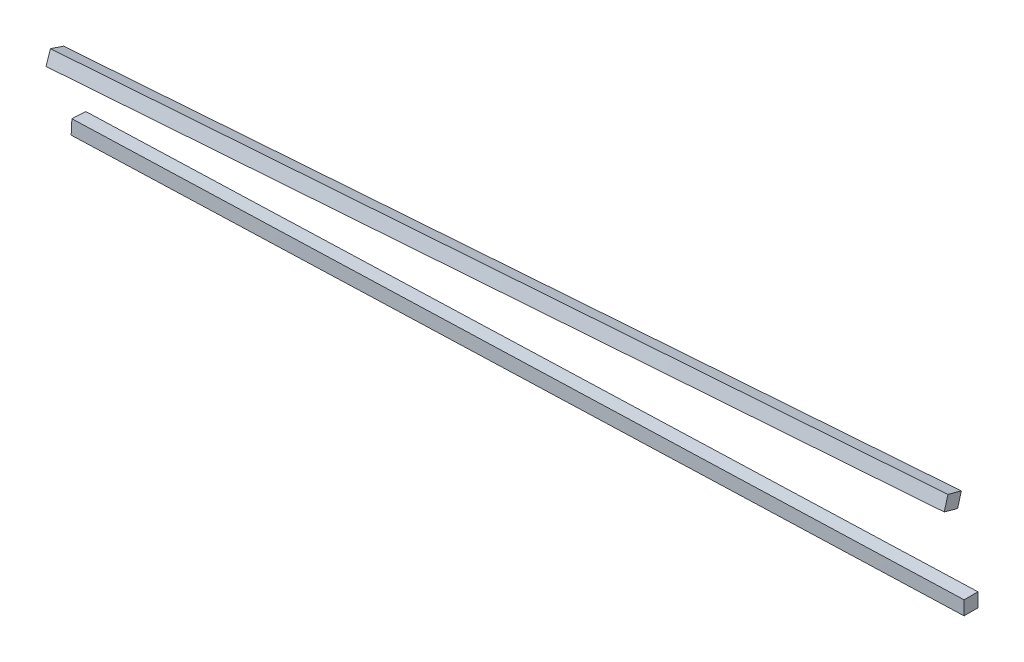
ISO-10303-21;
HEADER;
FILE_DESCRIPTION(('STEP AP214'),'2;1');
FILE_NAME('part.step','',(''),(''),'','','');
FILE_SCHEMA(('AUTOMOTIVE_DESIGN { 1 0 10303 214 1 1 1 1 }'));
ENDSEC;
DATA;
#1=APPLICATION_CONTEXT('core data for automotive mechanical design processes');
#2=APPLICATION_PROTOCOL_DEFINITION('international standard','automotive_design',2000,#1);
#3=PRODUCT_CONTEXT('',#1,'mechanical');
#4=PRODUCT('Part','Part','',(#3));
#5=PRODUCT_RELATED_PRODUCT_CATEGORY('part','',(#4));
#6=PRODUCT_DEFINITION_FORMATION('','',#4);
#7=PRODUCT_DEFINITION_CONTEXT('part definition',#1,'design');
#8=PRODUCT_DEFINITION('design','',#6,#7);
#9=PRODUCT_DEFINITION_SHAPE('','',#8);
#10=(LENGTH_UNIT() NAMED_UNIT(*) SI_UNIT(.MILLI.,.METRE.));
#11=(NAMED_UNIT(*) PLANE_ANGLE_UNIT() SI_UNIT($,.RADIAN.));
#12=(NAMED_UNIT(*) SI_UNIT($,.STERADIAN.) SOLID_ANGLE_UNIT());
#13=UNCERTAINTY_MEASURE_WITH_UNIT(LENGTH_MEASURE(1.E-05),#10,'distance_accuracy_value','');
#14=(GEOMETRIC_REPRESENTATION_CONTEXT(3) GLOBAL_UNCERTAINTY_ASSIGNED_CONTEXT((#13)) GLOBAL_UNIT_ASSIGNED_CONTEXT((#10,
#11,#12)) REPRESENTATION_CONTEXT('',''));
#15=CARTESIAN_POINT('',(0.,0.,0.));
#16=DIRECTION('',(0.,0.,1.));
#17=DIRECTION('',(1.,0.,0.));
#18=AXIS2_PLACEMENT_3D('',#15,#16,#17);
#19=CARTESIAN_POINT('',(-301.244,0.,0.));
#20=DIRECTION('',(1.,0.,0.));
#21=DIRECTION('',(0.,0.,-1.));
#22=AXIS2_PLACEMENT_3D('',#19,#20,#21);
#23=PLANE('',#22);
#24=DIRECTION('',(0.,0.998681754470149,-0.0513298479291129));
#25=VECTOR('',#24,1.);
#26=CARTESIAN_POINT('',(-301.244,-54.3131968202896,-76.6565977528262));
#27=LINE('',#26,#25);
#28=CARTESIAN_POINT('',(-301.244,-54.3131968202896,-76.6565977528262));
#29=VERTEX_POINT('',#28);
#30=CARTESIAN_POINT('',(-301.244,-49.4935586732166,-76.9043155989321));
#31=VERTEX_POINT('',#30);
#32=EDGE_CURVE('E143',#29,#31,#27,.T.);
#33=ORIENTED_EDGE('',*,*,#32,.F.);
#34=DIRECTION('',(0.,0.0513298479291094,0.998681754470149));
#35=VECTOR('',#34,1.);
#36=CARTESIAN_POINT('',(-301.244,-54.3131968202896,-76.6565977528262));
#37=LINE('',#36,#35);
#38=CARTESIAN_POINT('',(-301.244,-54.0654789741837,-71.8369596057533));
#39=VERTEX_POINT('',#38);
#40=EDGE_CURVE('E13',#29,#39,#37,.T.);
#41=ORIENTED_EDGE('',*,*,#40,.T.);
#42=DIRECTION('',(0.,0.998681754470149,-0.0513298479291069));
#43=VECTOR('',#42,1.);
#44=CARTESIAN_POINT('',(-301.244,-54.0654789741837,-71.8369596057533));
#45=LINE('',#44,#43);
#46=CARTESIAN_POINT('',(-301.244,-49.2458408271109,-72.0846774518592));
#47=VERTEX_POINT('',#46);
#48=EDGE_CURVE('E77',#39,#47,#45,.T.);
#49=ORIENTED_EDGE('',*,*,#48,.T.);
#50=DIRECTION('',(0.,0.0513298479290573,0.998681754470151));
#51=VECTOR('',#50,1.);
#52=CARTESIAN_POINT('',(-301.244,-49.4935586732166,-76.9043155989321));
#53=LINE('',#52,#51);
#54=EDGE_CURVE('E141',#31,#47,#53,.T.);
#55=ORIENTED_EDGE('',*,*,#54,.F.);
#56=EDGE_LOOP('',(#33,#41,#49,#55));
#57=FACE_BOUND('',#56,.T.);
#58=ADVANCED_FACE('F67',(#57),#23,.F.);
#59=CARTESIAN_POINT('',(0.,0.,0.));
#60=DIRECTION('',(-1.,0.,0.));
#61=DIRECTION('',(0.,0.,1.));
#62=AXIS2_PLACEMENT_3D('',#59,#60,#61);
#63=PLANE('',#62);
#64=DIRECTION('',(0.,0.999999249764561,-0.00122493686179626));
#65=VECTOR('',#64,1.);
#66=CARTESIAN_POINT('',(0.,-52.3639366169535,-80.6060154079807));
#67=LINE('',#66,#65);
#68=CARTESIAN_POINT('',(0.,-52.3639366169535,-80.6060154079807));
#69=VERTEX_POINT('',#68);
#70=CARTESIAN_POINT('',(0.,-47.5379402375898,-80.6119269532758));
#71=VERTEX_POINT('',#70);
#72=EDGE_CURVE('E116',#69,#71,#67,.T.);
#73=ORIENTED_EDGE('',*,*,#72,.F.);
#74=DIRECTION('',(0.,-0.00122493686179193,-0.999999249764561));
#75=VECTOR('',#74,1.);
#76=CARTESIAN_POINT('',(0.,-52.3639366169535,-80.6060154079807));
#77=LINE('',#76,#75);
#78=CARTESIAN_POINT('',(0.,-52.3698481622485,-85.4320117873445));
#79=VERTEX_POINT('',#78);
#80=EDGE_CURVE('E244',#69,#79,#77,.T.);
#81=ORIENTED_EDGE('',*,*,#80,.T.);
#82=DIRECTION('',(0.,0.999999249764561,-0.00122493686179337));
#83=VECTOR('',#82,1.);
#84=CARTESIAN_POINT('',(0.,-52.3698481622485,-85.4320117873445));
#85=LINE('',#84,#83);
#86=CARTESIAN_POINT('',(0.,-47.5438517828847,-85.4379233326396));
#87=VERTEX_POINT('',#86);
#88=EDGE_CURVE('E118',#79,#87,#85,.T.);
#89=ORIENTED_EDGE('',*,*,#88,.T.);
#90=DIRECTION('',(0.,-0.00122493686178187,-0.999999249764561));
#91=VECTOR('',#90,1.);
#92=CARTESIAN_POINT('',(0.,-47.5379402375898,-80.6119269532758));
#93=LINE('',#92,#91);
#94=EDGE_CURVE('E112',#71,#87,#93,.T.);
#95=ORIENTED_EDGE('',*,*,#94,.F.);
#96=EDGE_LOOP('',(#73,#81,#89,#95));
#97=FACE_BOUND('',#96,.T.);
#98=ADVANCED_FACE('F115',(#97),#63,.F.);
#99=CARTESIAN_POINT('',(0.,-47.5438517828847,-85.4379233326396));
#100=CARTESIAN_POINT('',(-301.244,-49.4935586732166,-76.9043155989321));
#101=CARTESIAN_POINT('',(0.,-48.3481845127787,-85.4369380750904));
#102=CARTESIAN_POINT('',(-301.244,-50.2968316977287,-76.8630292912478));
#103=CARTESIAN_POINT('',(0.,-49.1525172426727,-85.4359528175412));
#104=CARTESIAN_POINT('',(-301.244,-51.1001047222409,-76.8217429835635));
#105=CARTESIAN_POINT('',(0.,-50.7611827024606,-85.4339823024429));
#106=CARTESIAN_POINT('',(-301.244,-52.7066507712652,-76.7391703681949));
#107=CARTESIAN_POINT('',(0.,-51.5655154323546,-85.4329970448937));
#108=CARTESIAN_POINT('',(-301.244,-53.5099237957774,-76.6978840605105));
#109=CARTESIAN_POINT('',(0.,-52.3698481622485,-85.4320117873445));
#110=CARTESIAN_POINT('',(-301.244,-54.3131968202896,-76.6565977528262));
#111=B_SPLINE_SURFACE_WITH_KNOTS('',3,1,((#99,#100),(#101,#102),(#103,#104),(#105,#106),(#107,
#108),(#109,#110)),.UNSPECIFIED.,.F.,.F.,.F.,(4,2,4),(2,2),(0.,0.5,1.),(0.,1.),.UNSPECIFIED.);
#112=DIRECTION('',(-0.999555193249879,-0.00644820890520686,0.0291176278070954));
#113=VECTOR('',#112,1.);
#114=CARTESIAN_POINT('',(-150.622,-53.341522491269,-81.0443047700854));
#115=LINE('',#114,#113);
#116=EDGE_CURVE('E85',#79,#29,#115,.T.);
#117=DIRECTION('',(0.999578087821169,0.00646945428041606,-0.0283159409006493));
#118=VECTOR('',#117,1.);
#119=CARTESIAN_POINT('',(-150.622,-48.5187052280507,-81.1711194657858));
#120=LINE('',#119,#118);
#121=EDGE_CURVE('E156',#31,#87,#120,.T.);
#122=ORIENTED_EDGE('',*,*,#88,.F.);
#123=ORIENTED_EDGE('',*,*,#116,.T.);
#124=ORIENTED_EDGE('',*,*,#32,.T.);
#125=ORIENTED_EDGE('',*,*,#121,.T.);
#126=EDGE_LOOP('',(#122,#123,#124,#125));
#127=FACE_BOUND('',#126,.T.);
#128=ADVANCED_FACE('F197',(#127),#111,.T.);
#129=CARTESIAN_POINT('',(0.,-52.3698481622485,-85.4320117873445));
#130=CARTESIAN_POINT('',(-301.244,-54.3131968202896,-76.6565977528262));
#131=CARTESIAN_POINT('',(0.,-52.3688629046993,-84.6276790574505));
#132=CARTESIAN_POINT('',(-301.244,-54.2719105126053,-75.8533247283141));
#133=CARTESIAN_POINT('',(0.,-52.3678776471502,-83.8233463275565));
#134=CARTESIAN_POINT('',(-301.244,-54.2306242049209,-75.0500517038019));
#135=CARTESIAN_POINT('',(0.,-52.3659071320518,-82.2146808677686));
#136=CARTESIAN_POINT('',(-301.244,-54.1480515895523,-73.4435056547776));
#137=CARTESIAN_POINT('',(0.,-52.3649218745027,-81.4103481378746));
#138=CARTESIAN_POINT('',(-301.244,-54.106765281868,-72.6402326302655));
#139=CARTESIAN_POINT('',(0.,-52.3639366169535,-80.6060154079807));
#140=CARTESIAN_POINT('',(-301.244,-54.0654789741837,-71.8369596057533));
#141=B_SPLINE_SURFACE_WITH_KNOTS('',3,1,((#129,#130),(#131,#132),(#133,#134),(#135,#136),(#137,
#138),(#139,#140)),.UNSPECIFIED.,.F.,.F.,.F.,(4,2,4),(2,2),(0.,0.5,1.),(0.,1.),.UNSPECIFIED.);
#142=DIRECTION('',(-0.999560656696797,-0.00564590430345644,0.0290966896478778));
#143=VECTOR('',#142,1.);
#144=CARTESIAN_POINT('',(-150.622,-53.2147077955686,-76.221487506867));
#145=LINE('',#144,#143);
#146=EDGE_CURVE('E134',#69,#39,#145,.T.);
#147=ORIENTED_EDGE('',*,*,#80,.F.);
#148=ORIENTED_EDGE('',*,*,#146,.T.);
#149=ORIENTED_EDGE('',*,*,#40,.F.);
#150=ORIENTED_EDGE('',*,*,#116,.F.);
#151=EDGE_LOOP('',(#147,#148,#149,#150));
#152=FACE_BOUND('',#151,.T.);
#153=ADVANCED_FACE('F168',(#152),#141,.T.);
#154=CARTESIAN_POINT('',(0.,-47.5379402375898,-80.6119269532758));
#155=CARTESIAN_POINT('',(-301.244,-49.2458408271109,-72.0846774518592));
#156=CARTESIAN_POINT('',(0.,-47.5389254951389,-81.4162596831702));
#157=CARTESIAN_POINT('',(-301.244,-49.2871271347952,-72.8879504763713));
#158=CARTESIAN_POINT('',(0.,-47.5399107526881,-82.2205924130644));
#159=CARTESIAN_POINT('',(-301.244,-49.3284134424795,-73.6912235008835));
#160=CARTESIAN_POINT('',(0.,-47.5418812677864,-83.8292578728523));
#161=CARTESIAN_POINT('',(-301.244,-49.410986057848,-75.2977695499078));
#162=CARTESIAN_POINT('',(0.,-47.5428665253356,-84.6335906027461));
#163=CARTESIAN_POINT('',(-301.244,-49.4522723655323,-76.10104257442));
#164=CARTESIAN_POINT('',(0.,-47.5438517828847,-85.4379233326396));
#165=CARTESIAN_POINT('',(-301.244,-49.4935586732166,-76.9043155989321));
#166=B_SPLINE_SURFACE_WITH_KNOTS('',3,1,((#154,#155),(#156,#157),(#158,#159),(#160,#161),(#162,
#163),(#164,#165)),.UNSPECIFIED.,.F.,.F.,.F.,(4,2,4),(2,2),(0.,0.5,1.),(0.,1.),.UNSPECIFIED.);
#167=DIRECTION('',(-0.999583551643514,-0.00566713141880874,0.028294997883365));
#168=VECTOR('',#167,1.);
#169=CARTESIAN_POINT('',(-150.622,-48.3918905323504,-76.3483022025675));
#170=LINE('',#169,#168);
#171=EDGE_CURVE('E132',#71,#47,#170,.T.);
#172=ORIENTED_EDGE('',*,*,#94,.T.);
#173=ORIENTED_EDGE('',*,*,#121,.F.);
#174=ORIENTED_EDGE('',*,*,#54,.T.);
#175=ORIENTED_EDGE('',*,*,#171,.F.);
#176=EDGE_LOOP('',(#172,#173,#174,#175));
#177=FACE_BOUND('',#176,.T.);
#178=ADVANCED_FACE('F140',(#177),#166,.T.);
#179=CARTESIAN_POINT('',(0.,-52.3639366169535,-80.6060154079807));
#180=CARTESIAN_POINT('',(-301.244,-54.0654789741837,-71.8369596057533));
#181=CARTESIAN_POINT('',(0.,-51.5596038870595,-80.6070006655299));
#182=CARTESIAN_POINT('',(-301.244,-53.2622059496716,-71.8782459134376));
#183=CARTESIAN_POINT('',(0.,-50.7552711571656,-80.6079859230791));
#184=CARTESIAN_POINT('',(-301.244,-52.4589329251595,-71.9195322211219));
#185=CARTESIAN_POINT('',(0.,-49.1466056973777,-80.6099564381774));
#186=CARTESIAN_POINT('',(-301.244,-50.8523868761353,-72.0021048364905));
#187=CARTESIAN_POINT('',(0.,-48.3422729674837,-80.6109416957266));
#188=CARTESIAN_POINT('',(-301.244,-50.0491138516231,-72.0433911441748));
#189=CARTESIAN_POINT('',(0.,-47.5379402375898,-80.6119269532758));
#190=CARTESIAN_POINT('',(-301.244,-49.2458408271109,-72.0846774518592));
#191=B_SPLINE_SURFACE_WITH_KNOTS('',3,1,((#179,#180),(#181,#182),(#183,#184),(#185,#186),(#187,
#188),(#189,#190)),.UNSPECIFIED.,.F.,.F.,.F.,(4,2,4),(2,2),(0.,0.5,1.),(0.,1.),.UNSPECIFIED.);
#192=ORIENTED_EDGE('',*,*,#72,.T.);
#193=ORIENTED_EDGE('',*,*,#171,.T.);
#194=ORIENTED_EDGE('',*,*,#48,.F.);
#195=ORIENTED_EDGE('',*,*,#146,.F.);
#196=EDGE_LOOP('',(#192,#193,#194,#195));
#197=FACE_BOUND('',#196,.T.);
#198=ADVANCED_FACE('F131',(#197),#191,.T.);
#199=CLOSED_SHELL('',(#58,#98,#128,#153,#178,#198));
#200=MANIFOLD_SOLID_BREP('B2',#199);
#201=CARTESIAN_POINT('',(-301.244,0.,0.));
#202=DIRECTION('',(1.,0.,0.));
#203=DIRECTION('',(0.,0.,-1.));
#204=AXIS2_PLACEMENT_3D('',#201,#202,#203);
#205=PLANE('',#204);
#206=DIRECTION('',(0.,0.948597586448129,-0.316484784760317));
#207=VECTOR('',#206,1.);
#208=CARTESIAN_POINT('',(-301.244,-30.5643098408637,-67.6798509574859));
#209=LINE('',#208,#207);
#210=CARTESIAN_POINT('',(-301.244,-30.5643098408637,-67.6798509574859));
#211=VERTEX_POINT('',#210);
#212=CARTESIAN_POINT('',(-301.244,-25.986377888665,-69.2072065287391));
#213=VERTEX_POINT('',#212);
#214=EDGE_CURVE('E516',#211,#213,#209,.T.);
#215=ORIENTED_EDGE('',*,*,#214,.F.);
#216=DIRECTION('',(0.,0.316484784760316,0.948597586448129));
#217=VECTOR('',#216,1.);
#218=CARTESIAN_POINT('',(-301.244,-30.5643098408637,-67.6798509574859));
#219=LINE('',#218,#217);
#220=CARTESIAN_POINT('',(-301.244,-29.0369542696104,-63.1019190052872));
#221=VERTEX_POINT('',#220);
#222=EDGE_CURVE('E65',#211,#221,#219,.T.);
#223=ORIENTED_EDGE('',*,*,#222,.T.);
#224=DIRECTION('',(0.,0.948597586448129,-0.316484784760317));
#225=VECTOR('',#224,1.);
#226=CARTESIAN_POINT('',(-301.244,-29.0369542696104,-63.1019190052872));
#227=LINE('',#226,#225);
#228=CARTESIAN_POINT('',(-301.244,-24.4590223174117,-64.6292745765404));
#229=VERTEX_POINT('',#228);
#230=EDGE_CURVE('E401',#221,#229,#227,.T.);
#231=ORIENTED_EDGE('',*,*,#230,.T.);
#232=DIRECTION('',(0.,0.316484784760317,0.948597586448129));
#233=VECTOR('',#232,1.);
#234=CARTESIAN_POINT('',(-301.244,-25.986377888665,-69.2072065287391));
#235=LINE('',#234,#233);
#236=EDGE_CURVE('E443',#213,#229,#235,.T.);
#237=ORIENTED_EDGE('',*,*,#236,.F.);
#238=EDGE_LOOP('',(#215,#223,#231,#237));
#239=FACE_BOUND('',#238,.T.);
#240=ADVANCED_FACE('F391',(#239),#205,.F.);
#241=CARTESIAN_POINT('',(0.,0.,0.));
#242=DIRECTION('',(1.,0.,0.));
#243=DIRECTION('',(0.,0.,-1.));
#244=AXIS2_PLACEMENT_3D('',#241,#242,#243);
#245=PLANE('',#244);
#246=DIRECTION('',(0.,-0.264944987657992,-0.964263529080565));
#247=VECTOR('',#246,1.);
#248=CARTESIAN_POINT('',(0.,-17.6892857922132,-73.7225928427553));
#249=LINE('',#248,#247);
#250=CARTESIAN_POINT('',(0.,-17.6892857922132,-73.7225928427553));
#251=VERTEX_POINT('',#250);
#252=CARTESIAN_POINT('',(0.,-18.9679103026507,-78.3761286340981));
#253=VERTEX_POINT('',#252);
#254=EDGE_CURVE('E504',#251,#253,#249,.T.);
#255=ORIENTED_EDGE('',*,*,#254,.T.);
#256=DIRECTION('',(0.,0.964263529080565,-0.264944987657993));
#257=VECTOR('',#256,1.);
#258=CARTESIAN_POINT('',(0.,-18.9679103026507,-78.3761286340981));
#259=LINE('',#258,#257);
#260=CARTESIAN_POINT('',(0.,-14.3143745113079,-79.6547531445356));
#261=VERTEX_POINT('',#260);
#262=EDGE_CURVE('E463',#253,#261,#259,.T.);
#263=ORIENTED_EDGE('',*,*,#262,.T.);
#264=DIRECTION('',(0.,-0.264944987657993,-0.964263529080565));
#265=VECTOR('',#264,1.);
#266=CARTESIAN_POINT('',(0.,-13.0357500008704,-75.0012173531927));
#267=LINE('',#266,#265);
#268=CARTESIAN_POINT('',(0.,-13.0357500008704,-75.0012173531927));
#269=VERTEX_POINT('',#268);
#270=EDGE_CURVE('E440',#269,#261,#267,.T.);
#271=ORIENTED_EDGE('',*,*,#270,.F.);
#272=DIRECTION('',(0.,0.964263529080565,-0.264944987657993));
#273=VECTOR('',#272,1.);
#274=CARTESIAN_POINT('',(0.,-17.6892857922132,-73.7225928427553));
#275=LINE('',#274,#273);
#276=EDGE_CURVE('E447',#251,#269,#275,.T.);
#277=ORIENTED_EDGE('',*,*,#276,.F.);
#278=EDGE_LOOP('',(#255,#263,#271,#277));
#279=FACE_BOUND('',#278,.T.);
#280=ADVANCED_FACE('F462',(#279),#245,.T.);
#281=CARTESIAN_POINT('',(0.,-13.0357500008704,-75.0012173531927));
#282=CARTESIAN_POINT('',(-301.244,-24.4590223174117,-64.6292745765404));
#283=CARTESIAN_POINT('',(0.,-13.2488540859433,-75.7768066517498));
#284=CARTESIAN_POINT('',(-301.244,-24.7135815792873,-65.3922632352402));
#285=CARTESIAN_POINT('',(0.,-13.4619581710162,-76.5523959503069));
#286=CARTESIAN_POINT('',(-301.244,-24.9681408411628,-66.15525189394));
#287=CARTESIAN_POINT('',(0.,-13.888166341162,-78.1035745474211));
#288=CARTESIAN_POINT('',(-301.244,-25.4772593649139,-67.6812292113396));
#289=CARTESIAN_POINT('',(0.,-14.1012704262349,-78.8791638459783));
#290=CARTESIAN_POINT('',(-301.244,-25.7318186267895,-68.4442178700394));
#291=CARTESIAN_POINT('',(0.,-14.3143745113079,-79.6547531445356));
#292=CARTESIAN_POINT('',(-301.244,-25.986377888665,-69.2072065287391));
#293=B_SPLINE_SURFACE_WITH_KNOTS('',3,1,((#281,#282),(#283,#284),(#285,#286),(#287,#288),(#289,
#290),(#291,#292)),.UNSPECIFIED.,.F.,.F.,.F.,(4,2,4),(2,2),(0.,0.5,1.),(0.,1.),.UNSPECIFIED.);
#294=DIRECTION('',(-0.99865071131137,-0.0386937315771483,0.0346345482709159));
#295=VECTOR('',#294,1.);
#296=CARTESIAN_POINT('',(-150.622,-20.1503761999865,-74.4309798366373));
#297=LINE('',#296,#295);
#298=EDGE_CURVE('E446',#261,#213,#297,.T.);
#299=DIRECTION('',(0.998690874208296,0.0378706889303227,-0.0343852976286774));
#300=VECTOR('',#299,1.);
#301=CARTESIAN_POINT('',(-150.622,-18.7473861591411,-69.8152459648666));
#302=LINE('',#301,#300);
#303=EDGE_CURVE('E435',#229,#269,#302,.T.);
#304=ORIENTED_EDGE('',*,*,#270,.T.);
#305=ORIENTED_EDGE('',*,*,#298,.T.);
#306=ORIENTED_EDGE('',*,*,#236,.T.);
#307=ORIENTED_EDGE('',*,*,#303,.T.);
#308=EDGE_LOOP('',(#304,#305,#306,#307));
#309=FACE_BOUND('',#308,.T.);
#310=ADVANCED_FACE('F437',(#309),#293,.T.);
#311=CARTESIAN_POINT('',(0.,-14.3143745113079,-79.6547531445356));
#312=CARTESIAN_POINT('',(-301.244,-25.986377888665,-69.2072065287391));
#313=CARTESIAN_POINT('',(0.,-15.089963809865,-79.4416490594627));
#314=CARTESIAN_POINT('',(-301.244,-26.7493665473648,-68.9526472668636));
#315=CARTESIAN_POINT('',(0.,-15.8655531084221,-79.2285449743897));
#316=CARTESIAN_POINT('',(-301.244,-27.5123552060646,-68.698088004988));
#317=CARTESIAN_POINT('',(0.,-17.4167317055364,-78.8023368042439));
#318=CARTESIAN_POINT('',(-301.244,-29.0383325234642,-68.1889694812369));
#319=CARTESIAN_POINT('',(0.,-18.1923210040935,-78.589232719171));
#320=CARTESIAN_POINT('',(-301.244,-29.8013211821639,-67.9344102193614));
#321=CARTESIAN_POINT('',(0.,-18.9679103026507,-78.3761286340981));
#322=CARTESIAN_POINT('',(-301.244,-30.5643098408637,-67.6798509574859));
#323=B_SPLINE_SURFACE_WITH_KNOTS('',3,1,((#311,#312),(#313,#314),(#315,#316),(#317,#318),(#319,
#320),(#321,#322)),.UNSPECIFIED.,.F.,.F.,.F.,(4,2,4),(2,2),(0.,0.5,1.),(0.,1.),.UNSPECIFIED.);
#324=DIRECTION('',(-0.998631505937625,-0.0384423587998436,0.0354584319824537));
#325=VECTOR('',#324,1.);
#326=CARTESIAN_POINT('',(-150.622,-24.7661100717572,-73.027989795792));
#327=LINE('',#326,#325);
#328=EDGE_CURVE('E409',#253,#211,#327,.T.);
#329=ORIENTED_EDGE('',*,*,#262,.F.);
#330=ORIENTED_EDGE('',*,*,#328,.T.);
#331=ORIENTED_EDGE('',*,*,#214,.T.);
#332=ORIENTED_EDGE('',*,*,#298,.F.);
#333=EDGE_LOOP('',(#329,#330,#331,#332));
#334=FACE_BOUND('',#333,.T.);
#335=ADVANCED_FACE('F565',(#334),#323,.T.);
#336=CARTESIAN_POINT('',(0.,-17.6892857922132,-73.7225928427553));
#337=CARTESIAN_POINT('',(-301.244,-29.0369542696104,-63.1019190052872));
#338=CARTESIAN_POINT('',(0.,-16.9136964936561,-73.9356969278282));
#339=CARTESIAN_POINT('',(-301.244,-28.2739656109106,-63.3564782671627));
#340=CARTESIAN_POINT('',(0.,-16.1381071950989,-74.1488010129011));
#341=CARTESIAN_POINT('',(-301.244,-27.5109769522109,-63.6110375290382));
#342=CARTESIAN_POINT('',(0.,-14.5869285979847,-74.5750091830469));
#343=CARTESIAN_POINT('',(-301.244,-25.9849996348113,-64.1201560527893));
#344=CARTESIAN_POINT('',(0.,-13.8113392994275,-74.7881132681198));
#345=CARTESIAN_POINT('',(-301.244,-25.2220109761115,-64.3747153146649));
#346=CARTESIAN_POINT('',(0.,-13.0357500008704,-75.0012173531927));
#347=CARTESIAN_POINT('',(-301.244,-24.4590223174117,-64.6292745765404));
#348=B_SPLINE_SURFACE_WITH_KNOTS('',3,1,((#336,#337),(#338,#339),(#340,#341),(#342,#343),(#344,
#345),(#346,#347)),.UNSPECIFIED.,.F.,.F.,.F.,(4,2,4),(2,2),(0.,0.5,1.),(0.,1.),.UNSPECIFIED.);
#349=DIRECTION('',(-0.998671666517346,-0.0376193218434513,0.035209219240222));
#350=VECTOR('',#349,1.);
#351=CARTESIAN_POINT('',(-150.622,-23.3631200309118,-68.4122559240212));
#352=LINE('',#351,#350);
#353=EDGE_CURVE('E453',#251,#221,#352,.T.);
#354=ORIENTED_EDGE('',*,*,#276,.T.);
#355=ORIENTED_EDGE('',*,*,#303,.F.);
#356=ORIENTED_EDGE('',*,*,#230,.F.);
#357=ORIENTED_EDGE('',*,*,#353,.F.);
#358=EDGE_LOOP('',(#354,#355,#356,#357));
#359=FACE_BOUND('',#358,.T.);
#360=ADVANCED_FACE('F451',(#359),#348,.T.);
#361=CARTESIAN_POINT('',(0.,-18.9679103026507,-78.3761286340981));
#362=CARTESIAN_POINT('',(-301.244,-30.5643098408637,-67.6798509574859));
#363=CARTESIAN_POINT('',(0.,-18.7548062175778,-77.600539335541));
#364=CARTESIAN_POINT('',(-301.244,-30.3097505789882,-66.916862298786));
#365=CARTESIAN_POINT('',(0.,-18.5417021325049,-76.8249500369839));
#366=CARTESIAN_POINT('',(-301.244,-30.0551913171126,-66.1538736400862));
#367=CARTESIAN_POINT('',(0.,-18.115493962359,-75.2737714398696));
#368=CARTESIAN_POINT('',(-301.244,-29.5460727933615,-64.6278963226867));
#369=CARTESIAN_POINT('',(0.,-17.9023898772861,-74.4981821413124));
#370=CARTESIAN_POINT('',(-301.244,-29.291513531486,-63.8649076639869));
#371=CARTESIAN_POINT('',(0.,-17.6892857922132,-73.7225928427553));
#372=CARTESIAN_POINT('',(-301.244,-29.0369542696104,-63.1019190052872));
#373=B_SPLINE_SURFACE_WITH_KNOTS('',3,1,((#361,#362),(#363,#364),(#365,#366),(#367,#368),(#369,
#370),(#371,#372)),.UNSPECIFIED.,.F.,.F.,.F.,(4,2,4),(2,2),(0.,0.5,1.),(0.,1.),.UNSPECIFIED.);
#374=ORIENTED_EDGE('',*,*,#254,.F.);
#375=ORIENTED_EDGE('',*,*,#353,.T.);
#376=ORIENTED_EDGE('',*,*,#222,.F.);
#377=ORIENTED_EDGE('',*,*,#328,.F.);
#378=EDGE_LOOP('',(#374,#375,#376,#377));
#379=FACE_BOUND('',#378,.T.);
#380=ADVANCED_FACE('F616',(#379),#373,.T.);
#381=CLOSED_SHELL('',(#240,#280,#310,#335,#360,#380));
#382=MANIFOLD_SOLID_BREP('B7',#381);
#383=ADVANCED_BREP_SHAPE_REPRESENTATION('',(#18,#200,#382),#14);
#384=SHAPE_DEFINITION_REPRESENTATION(#9,#383);
ENDSEC;
END-ISO-10303-21;
